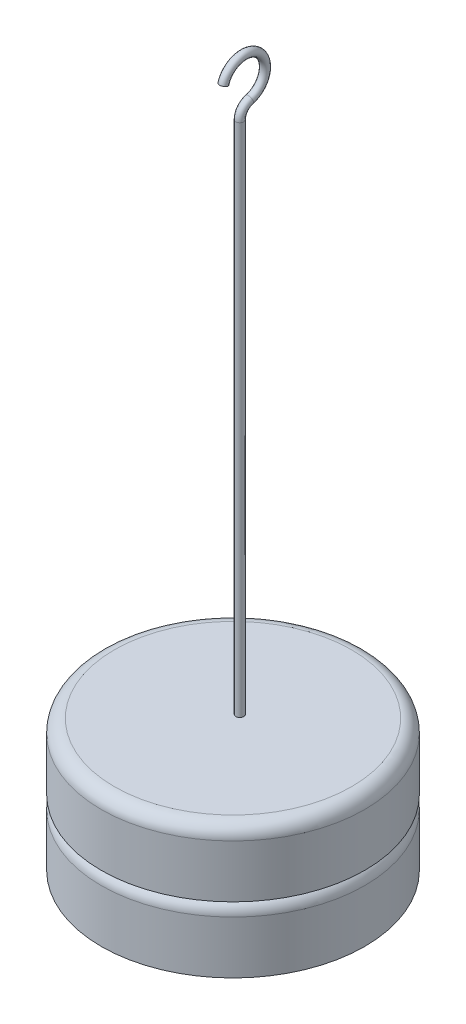
ISO-10303-21;
HEADER;
FILE_DESCRIPTION(('STEP AP214'),'2;1');
FILE_NAME('part.step','',(''),(''),'','','');
FILE_SCHEMA(('AUTOMOTIVE_DESIGN { 1 0 10303 214 1 1 1 1 }'));
ENDSEC;
DATA;
#1=APPLICATION_CONTEXT('core data for automotive mechanical design processes');
#2=APPLICATION_PROTOCOL_DEFINITION('international standard','automotive_design',2000,#1);
#3=PRODUCT_CONTEXT('',#1,'mechanical');
#4=PRODUCT('Part','Part','',(#3));
#5=PRODUCT_RELATED_PRODUCT_CATEGORY('part','',(#4));
#6=PRODUCT_DEFINITION_FORMATION('','',#4);
#7=PRODUCT_DEFINITION_CONTEXT('part definition',#1,'design');
#8=PRODUCT_DEFINITION('design','',#6,#7);
#9=PRODUCT_DEFINITION_SHAPE('','',#8);
#10=(LENGTH_UNIT() NAMED_UNIT(*) SI_UNIT(.MILLI.,.METRE.));
#11=(NAMED_UNIT(*) PLANE_ANGLE_UNIT() SI_UNIT($,.RADIAN.));
#12=(NAMED_UNIT(*) SI_UNIT($,.STERADIAN.) SOLID_ANGLE_UNIT());
#13=UNCERTAINTY_MEASURE_WITH_UNIT(LENGTH_MEASURE(1.E-05),#10,'distance_accuracy_value','');
#14=(GEOMETRIC_REPRESENTATION_CONTEXT(3) GLOBAL_UNCERTAINTY_ASSIGNED_CONTEXT((#13)) GLOBAL_UNIT_ASSIGNED_CONTEXT((#10,
#11,#12)) REPRESENTATION_CONTEXT('',''));
#15=CARTESIAN_POINT('',(0.,0.,0.));
#16=DIRECTION('',(0.,0.,1.));
#17=DIRECTION('',(1.,0.,0.));
#18=AXIS2_PLACEMENT_3D('',#15,#16,#17);
#19=CARTESIAN_POINT('',(0.,6.35,0.));
#20=DIRECTION('',(0.,-1.,0.));
#21=DIRECTION('',(0.,0.,-1.));
#22=AXIS2_PLACEMENT_3D('',#19,#20,#21);
#23=CYLINDRICAL_SURFACE('',#22,12.7);
#24=CARTESIAN_POINT('',(0.,5.08,0.));
#25=DIRECTION('',(0.,1.,0.));
#26=DIRECTION('',(0.,0.,1.));
#27=AXIS2_PLACEMENT_3D('',#24,#25,#26);
#28=CIRCLE('',#27,12.7);
#29=CARTESIAN_POINT('',(0.,5.08,12.7));
#30=VERTEX_POINT('',#29);
#31=EDGE_CURVE('E54',#30,#30,#28,.F.);
#32=ORIENTED_EDGE('',*,*,#31,.T.);
#33=EDGE_LOOP('',(#32));
#34=FACE_BOUND('',#33,.T.);
#35=CARTESIAN_POINT('',(0.,0.,0.));
#36=DIRECTION('',(0.,1.,0.));
#37=DIRECTION('',(0.,0.,1.));
#38=AXIS2_PLACEMENT_3D('',#35,#36,#37);
#39=CIRCLE('',#38,12.7);
#40=CARTESIAN_POINT('',(0.,0.,12.7));
#41=VERTEX_POINT('',#40);
#42=EDGE_CURVE('E63',#41,#41,#39,.T.);
#43=ORIENTED_EDGE('',*,*,#42,.T.);
#44=EDGE_LOOP('',(#43));
#45=FACE_BOUND('',#44,.T.);
#46=ADVANCED_FACE('F43',(#34,#45),#23,.T.);
#47=CARTESIAN_POINT('',(0.,0.,0.));
#48=DIRECTION('',(0.,1.,0.));
#49=DIRECTION('',(0.,0.,1.));
#50=AXIS2_PLACEMENT_3D('',#47,#48,#49);
#51=PLANE('',#50);
#52=ORIENTED_EDGE('',*,*,#42,.F.);
#53=EDGE_LOOP('',(#52));
#54=FACE_BOUND('',#53,.T.);
#55=ADVANCED_FACE('F98',(#54),#51,.F.);
#56=CARTESIAN_POINT('',(0.,5.08,0.));
#57=DIRECTION('',(0.,1.,0.));
#58=DIRECTION('',(0.,0.,1.));
#59=AXIS2_PLACEMENT_3D('',#56,#57,#58);
#60=TOROIDAL_SURFACE('',#59,11.43,1.27);
#61=ORIENTED_EDGE('',*,*,#31,.F.);
#62=EDGE_LOOP('',(#61));
#63=FACE_BOUND('',#62,.T.);
#64=CARTESIAN_POINT('',(0.,6.35,0.));
#65=DIRECTION('',(0.,1.,0.));
#66=DIRECTION('',(0.,0.,1.));
#67=AXIS2_PLACEMENT_3D('',#64,#65,#66);
#68=CIRCLE('',#67,11.43);
#69=CARTESIAN_POINT('',(0.,6.35,11.43));
#70=VERTEX_POINT('',#69);
#71=EDGE_CURVE('E58',#70,#70,#68,.T.);
#72=ORIENTED_EDGE('',*,*,#71,.F.);
#73=EDGE_LOOP('',(#72));
#74=FACE_BOUND('',#73,.T.);
#75=ADVANCED_FACE('F104',(#63,#74),#60,.T.);
#76=CARTESIAN_POINT('',(0.,12.7,0.));
#77=DIRECTION('',(0.,-1.,0.));
#78=DIRECTION('',(0.,0.,-1.));
#79=AXIS2_PLACEMENT_3D('',#76,#77,#78);
#80=CYLINDRICAL_SURFACE('',#79,12.7);
#81=CARTESIAN_POINT('',(0.,11.43,0.));
#82=DIRECTION('',(0.,1.,0.));
#83=DIRECTION('',(0.,0.,1.));
#84=AXIS2_PLACEMENT_3D('',#81,#82,#83);
#85=CIRCLE('',#84,12.7);
#86=CARTESIAN_POINT('',(0.,11.43,12.7));
#87=VERTEX_POINT('',#86);
#88=EDGE_CURVE('E11',#87,#87,#85,.F.);
#89=ORIENTED_EDGE('',*,*,#88,.T.);
#90=EDGE_LOOP('',(#89));
#91=FACE_BOUND('',#90,.T.);
#92=CARTESIAN_POINT('',(0.,6.35,0.));
#93=DIRECTION('',(0.,1.,0.));
#94=DIRECTION('',(0.,0.,1.));
#95=AXIS2_PLACEMENT_3D('',#92,#93,#94);
#96=CIRCLE('',#95,12.7);
#97=CARTESIAN_POINT('',(0.,6.35,12.7));
#98=VERTEX_POINT('',#97);
#99=EDGE_CURVE('E66',#98,#98,#96,.T.);
#100=ORIENTED_EDGE('',*,*,#99,.T.);
#101=EDGE_LOOP('',(#100));
#102=FACE_BOUND('',#101,.T.);
#103=ADVANCED_FACE('F110',(#91,#102),#80,.T.);
#104=CARTESIAN_POINT('',(0.,12.7,0.));
#105=DIRECTION('',(0.,1.,0.));
#106=DIRECTION('',(0.,0.,1.));
#107=AXIS2_PLACEMENT_3D('',#104,#105,#106);
#108=PLANE('',#107);
#109=CARTESIAN_POINT('',(0.,12.7,-0.653856161896045));
#110=DIRECTION('',(0.,1.,0.));
#111=DIRECTION('',(0.,0.,1.));
#112=AXIS2_PLACEMENT_3D('',#109,#110,#111);
#113=CIRCLE('',#112,0.381);
#114=CARTESIAN_POINT('',(0.,12.7,-0.272856161896045));
#115=VERTEX_POINT('',#114);
#116=EDGE_CURVE('E69',#115,#115,#113,.T.);
#117=ORIENTED_EDGE('',*,*,#116,.F.);
#118=EDGE_LOOP('',(#117));
#119=FACE_BOUND('',#118,.T.);
#120=CARTESIAN_POINT('',(0.,12.7,0.));
#121=DIRECTION('',(0.,1.,0.));
#122=DIRECTION('',(0.,0.,1.));
#123=AXIS2_PLACEMENT_3D('',#120,#121,#122);
#124=CIRCLE('',#123,11.43);
#125=CARTESIAN_POINT('',(0.,12.7,11.43));
#126=VERTEX_POINT('',#125);
#127=EDGE_CURVE('E50',#126,#126,#124,.T.);
#128=ORIENTED_EDGE('',*,*,#127,.T.);
#129=EDGE_LOOP('',(#128));
#130=FACE_BOUND('',#129,.T.);
#131=ADVANCED_FACE('F115',(#119,#130),#108,.T.);
#132=CARTESIAN_POINT('',(0.,6.35,0.));
#133=DIRECTION('',(0.,1.,0.));
#134=DIRECTION('',(0.,0.,1.));
#135=AXIS2_PLACEMENT_3D('',#132,#133,#134);
#136=PLANE('',#135);
#137=ORIENTED_EDGE('',*,*,#71,.T.);
#138=EDGE_LOOP('',(#137));
#139=FACE_BOUND('',#138,.T.);
#140=ORIENTED_EDGE('',*,*,#99,.F.);
#141=EDGE_LOOP('',(#140));
#142=FACE_BOUND('',#141,.T.);
#143=ADVANCED_FACE('F120',(#139,#142),#136,.F.);
#144=CARTESIAN_POINT('',(0.,11.43,0.));
#145=DIRECTION('',(0.,1.,0.));
#146=DIRECTION('',(0.,0.,1.));
#147=AXIS2_PLACEMENT_3D('',#144,#145,#146);
#148=TOROIDAL_SURFACE('',#147,11.43,1.27);
#149=ORIENTED_EDGE('',*,*,#88,.F.);
#150=EDGE_LOOP('',(#149));
#151=FACE_BOUND('',#150,.T.);
#152=ORIENTED_EDGE('',*,*,#127,.F.);
#153=EDGE_LOOP('',(#152));
#154=FACE_BOUND('',#153,.T.);
#155=ADVANCED_FACE('F45',(#151,#154),#148,.T.);
#156=CARTESIAN_POINT('',(0.,66.0834270108211,0.937317322292647));
#157=DIRECTION('',(0.,-0.963063049902435,0.269275995797286));
#158=DIRECTION('',(0.,-0.269275995797286,-0.963063049902435));
#159=AXIS2_PLACEMENT_3D('',#156,#157,#158);
#160=PLANE('',#159);
#161=CARTESIAN_POINT('',(0.,66.0834270108211,0.937317322292647));
#162=DIRECTION('',(0.,-0.963063049902435,0.269275995797286));
#163=DIRECTION('',(0.,-0.269275995797286,-0.963063049902435));
#164=AXIS2_PLACEMENT_3D('',#161,#162,#163);
#165=CIRCLE('',#164,0.381);
#166=CARTESIAN_POINT('',(0.,66.1860211652198,1.30424434430547));
#167=VERTEX_POINT('',#166);
#168=EDGE_CURVE('E78',#167,#167,#165,.T.);
#169=ORIENTED_EDGE('',*,*,#168,.T.);
#170=EDGE_LOOP('',(#169));
#171=FACE_BOUND('',#170,.T.);
#172=ADVANCED_FACE('F82',(#171),#160,.T.);
#173=CARTESIAN_POINT('',(0.,65.532,-1.03485616189605));
#174=DIRECTION('',(-1.,0.,0.));
#175=DIRECTION('',(0.,0.,1.));
#176=AXIS2_PLACEMENT_3D('',#173,#174,#175);
#177=TOROIDAL_SURFACE('',#176,2.04781346806784,0.381);
#178=CARTESIAN_POINT('',(0.,63.5590679031847,-1.58356276961637));
#179=DIRECTION('',(0.,0.26794755297612,-0.963433499964636));
#180=DIRECTION('',(0.,0.963433499964637,0.26794755297612));
#181=AXIS2_PLACEMENT_3D('',#178,#179,#180);
#182=CIRCLE('',#181,0.381);
#183=CARTESIAN_POINT('',(0.,63.1919997396982,-1.68565078730027));
#184=VERTEX_POINT('',#183);
#185=EDGE_CURVE('E75',#184,#184,#182,.T.);
#186=CARTESIAN_POINT('',(0.,65.532,-1.03485616189605));
#187=DIRECTION('',(-1.,0.,0.));
#188=DIRECTION('',(0.,0.,1.));
#189=AXIS2_PLACEMENT_3D('',#186,#187,#188);
#190=CIRCLE('',#189,2.42881346806784);
#191=EDGE_CURVE('',#167,#184,#190,.T.);
#192=ORIENTED_EDGE('',*,*,#168,.F.);
#193=ORIENTED_EDGE('',*,*,#185,.T.);
#194=ORIENTED_EDGE('',*,*,#191,.T.);
#195=ORIENTED_EDGE('',*,*,#191,.F.);
#196=EDGE_LOOP('',(#192,#194,#193,#195));
#197=FACE_BOUND('',#196,.T.);
#198=ADVANCED_FACE('F84',(#197),#177,.T.);
#199=CARTESIAN_POINT('',(0.,62.3355073582296,-1.92385616189604));
#200=DIRECTION('',(1.,0.,0.));
#201=DIRECTION('',(0.,0.,-1.));
#202=AXIS2_PLACEMENT_3D('',#199,#200,#201);
#203=TOROIDAL_SURFACE('',#202,1.27000000000001,0.381);
#204=CARTESIAN_POINT('',(0.,62.3355073582296,-0.653856161896035));
#205=DIRECTION('',(0.,1.,0.));
#206=DIRECTION('',(0.,0.,1.));
#207=AXIS2_PLACEMENT_3D('',#204,#205,#206);
#208=CIRCLE('',#207,0.381);
#209=CARTESIAN_POINT('',(0.,62.3355073582296,-0.272856161896035));
#210=VERTEX_POINT('',#209);
#211=EDGE_CURVE('E72',#210,#210,#208,.T.);
#212=ORIENTED_EDGE('',*,*,#211,.T.);
#213=EDGE_LOOP('',(#212));
#214=FACE_BOUND('',#213,.T.);
#215=ORIENTED_EDGE('',*,*,#185,.F.);
#216=EDGE_LOOP('',(#215));
#217=FACE_BOUND('',#216,.T.);
#218=ADVANCED_FACE('F86',(#214,#217),#203,.T.);
#219=CARTESIAN_POINT('',(0.,62.3355073582296,-0.653856161896039));
#220=DIRECTION('',(0.,-1.,0.));
#221=DIRECTION('',(0.,0.,-1.));
#222=AXIS2_PLACEMENT_3D('',#219,#220,#221);
#223=CYLINDRICAL_SURFACE('',#222,0.381);
#224=ORIENTED_EDGE('',*,*,#116,.T.);
#225=EDGE_LOOP('',(#224));
#226=FACE_BOUND('',#225,.T.);
#227=ORIENTED_EDGE('',*,*,#211,.F.);
#228=EDGE_LOOP('',(#227));
#229=FACE_BOUND('',#228,.T.);
#230=ADVANCED_FACE('F93',(#226,#229),#223,.T.);
#231=CLOSED_SHELL('',(#46,#55,#75,#103,#131,#143,#155,#172,#198,#218,#230));
#232=MANIFOLD_SOLID_BREP('B2',#231);
#233=ADVANCED_BREP_SHAPE_REPRESENTATION('',(#18,#232),#14);
#234=SHAPE_DEFINITION_REPRESENTATION(#9,#233);
ENDSEC;
END-ISO-10303-21;
